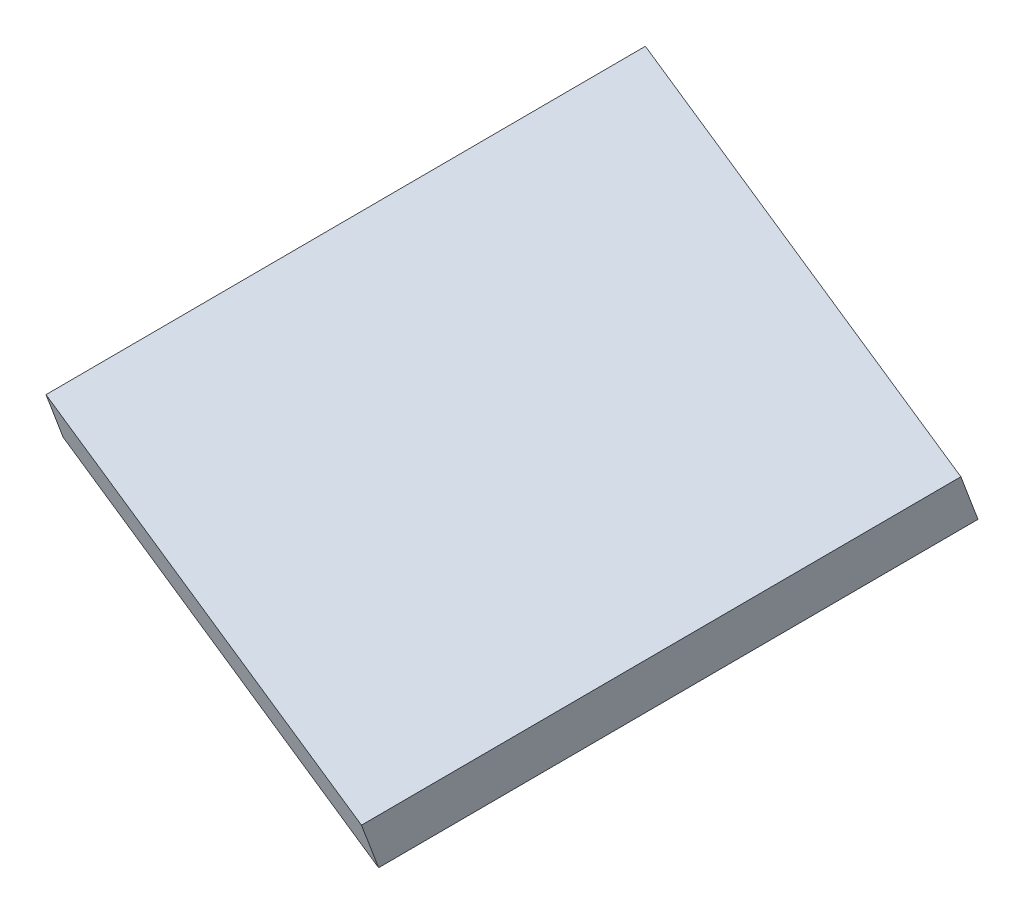
ISO-10303-21;
HEADER;
FILE_DESCRIPTION(('STEP AP214'),'2;1');
FILE_NAME('part.step','',(''),(''),'','','');
FILE_SCHEMA(('AUTOMOTIVE_DESIGN { 1 0 10303 214 1 1 1 1 }'));
ENDSEC;
DATA;
#1=APPLICATION_CONTEXT('core data for automotive mechanical design processes');
#2=APPLICATION_PROTOCOL_DEFINITION('international standard','automotive_design',2000,#1);
#3=PRODUCT_CONTEXT('',#1,'mechanical');
#4=PRODUCT('Part','Part','',(#3));
#5=PRODUCT_RELATED_PRODUCT_CATEGORY('part','',(#4));
#6=PRODUCT_DEFINITION_FORMATION('','',#4);
#7=PRODUCT_DEFINITION_CONTEXT('part definition',#1,'design');
#8=PRODUCT_DEFINITION('design','',#6,#7);
#9=PRODUCT_DEFINITION_SHAPE('','',#8);
#10=(LENGTH_UNIT() NAMED_UNIT(*) SI_UNIT(.MILLI.,.METRE.));
#11=(NAMED_UNIT(*) PLANE_ANGLE_UNIT() SI_UNIT($,.RADIAN.));
#12=(NAMED_UNIT(*) SI_UNIT($,.STERADIAN.) SOLID_ANGLE_UNIT());
#13=UNCERTAINTY_MEASURE_WITH_UNIT(LENGTH_MEASURE(1.E-05),#10,'distance_accuracy_value','');
#14=(GEOMETRIC_REPRESENTATION_CONTEXT(3) GLOBAL_UNCERTAINTY_ASSIGNED_CONTEXT((#13)) GLOBAL_UNIT_ASSIGNED_CONTEXT((#10,
#11,#12)) REPRESENTATION_CONTEXT('',''));
#15=CARTESIAN_POINT('',(0.,0.,0.));
#16=DIRECTION('',(0.,0.,1.));
#17=DIRECTION('',(1.,0.,0.));
#18=AXIS2_PLACEMENT_3D('',#15,#16,#17);
#19=CARTESIAN_POINT('',(-209.831180180401,91.4337702418302,236.212830950044));
#20=DIRECTION('',(0.331348582738774,0.335518089768333,-0.881836565444649));
#21=DIRECTION('',(0.,0.934635619138035,0.355606888907488));
#22=AXIS2_PLACEMENT_3D('',#19,#20,#21);
#23=PLANE('',#22);
#24=DIRECTION('',(0.943421724808399,-0.130488029810082,0.304841472302947));
#25=VECTOR('',#24,1.);
#26=CARTESIAN_POINT('',(-209.895126618252,86.7690074249378,234.413970556566));
#27=LINE('',#26,#25);
#28=CARTESIAN_POINT('',(-257.066212858671,93.2934089154419,219.171896941419));
#29=VERTEX_POINT('',#28);
#30=CARTESIAN_POINT('',(-209.895126618252,86.7690074249378,234.413970556566));
#31=VERTEX_POINT('',#30);
#32=EDGE_CURVE('E77',#29,#31,#27,.T.);
#33=ORIENTED_EDGE('',*,*,#32,.T.);
#34=DIRECTION('',(-0.0127892875701102,-0.932952563378488,-0.359772078695605));
#35=VECTOR('',#34,1.);
#36=CARTESIAN_POINT('',(-209.831180180401,91.4337702418302,236.212830950044));
#37=LINE('',#36,#35);
#38=CARTESIAN_POINT('',(-209.831180180401,91.4337702418302,236.212830950044));
#39=VERTEX_POINT('',#38);
#40=EDGE_CURVE('E11',#39,#31,#37,.T.);
#41=ORIENTED_EDGE('',*,*,#40,.F.);
#42=DIRECTION('',(0.943421724808398,-0.130488029810081,0.30484147230295));
#43=VECTOR('',#42,1.);
#44=CARTESIAN_POINT('',(-245.557348824334,96.3751842843745,224.668876043376));
#45=LINE('',#44,#43);
#46=CARTESIAN_POINT('',(-257.002266420821,97.9581717323343,220.970757334897));
#47=VERTEX_POINT('',#46);
#48=EDGE_CURVE('E82',#47,#39,#45,.T.);
#49=ORIENTED_EDGE('',*,*,#48,.F.);
#50=DIRECTION('',(-0.0127892875701102,-0.932952563378488,-0.359772078695605));
#51=VECTOR('',#50,1.);
#52=CARTESIAN_POINT('',(-257.002266420821,97.9581717323343,220.970757334897));
#53=LINE('',#52,#51);
#54=EDGE_CURVE('E97',#47,#29,#53,.T.);
#55=ORIENTED_EDGE('',*,*,#54,.T.);
#56=EDGE_LOOP('',(#33,#41,#49,#55));
#57=FACE_BOUND('',#56,.T.);
#58=ADVANCED_FACE('F37',(#57),#23,.F.);
#59=CARTESIAN_POINT('',(-193.263751043462,108.209674730247,192.121002677812));
#60=DIRECTION('',(-0.943421724808399,0.130488029810082,-0.304841472302948));
#61=DIRECTION('',(-0.307470379466994,0.,0.951557652352406));
#62=AXIS2_PLACEMENT_3D('',#59,#60,#61);
#63=PLANE('',#62);
#64=DIRECTION('',(0.331348582738775,0.335518089768333,-0.881836565444648));
#65=VECTOR('',#64,1.);
#66=CARTESIAN_POINT('',(-193.327697481313,103.544911913354,190.322142284334));
#67=LINE('',#66,#65);
#68=CARTESIAN_POINT('',(-193.327697481313,103.544911913354,190.322142284334));
#69=VERTEX_POINT('',#68);
#70=EDGE_CURVE('E93',#31,#69,#67,.T.);
#71=ORIENTED_EDGE('',*,*,#70,.T.);
#72=DIRECTION('',(-0.0127892875701102,-0.932952563378488,-0.359772078695605));
#73=VECTOR('',#72,1.);
#74=CARTESIAN_POINT('',(-193.263751043462,108.209674730247,192.121002677812));
#75=LINE('',#74,#73);
#76=CARTESIAN_POINT('',(-193.263751043462,108.209674730247,192.121002677812));
#77=VERTEX_POINT('',#76);
#78=EDGE_CURVE('E45',#77,#69,#75,.T.);
#79=ORIENTED_EDGE('',*,*,#78,.F.);
#80=DIRECTION('',(0.331348582738775,0.335518089768333,-0.881836565444648));
#81=VECTOR('',#80,1.);
#82=CARTESIAN_POINT('',(-193.263751043462,108.209674730247,192.121002677812));
#83=LINE('',#82,#81);
#84=EDGE_CURVE('E85',#39,#77,#83,.T.);
#85=ORIENTED_EDGE('',*,*,#84,.F.);
#86=ORIENTED_EDGE('',*,*,#40,.T.);
#87=EDGE_LOOP('',(#71,#79,#85,#86));
#88=FACE_BOUND('',#87,.T.);
#89=ADVANCED_FACE('F92',(#88),#63,.F.);
#90=CARTESIAN_POINT('',(-240.434837283882,114.734076220751,176.878929062665));
#91=DIRECTION('',(-0.331348582738774,-0.335518089768333,0.881836565444649));
#92=DIRECTION('',(0.,-0.934635619138034,-0.355606888907488));
#93=AXIS2_PLACEMENT_3D('',#90,#91,#92);
#94=PLANE('',#93);
#95=DIRECTION('',(-0.943421724808399,0.130488029810081,-0.304841472302948));
#96=VECTOR('',#95,1.);
#97=CARTESIAN_POINT('',(-240.498783721733,110.069313403859,175.080068669187));
#98=LINE('',#97,#96);
#99=CARTESIAN_POINT('',(-240.498783721733,110.069313403859,175.080068669187));
#100=VERTEX_POINT('',#99);
#101=EDGE_CURVE('E70',#69,#100,#98,.T.);
#102=ORIENTED_EDGE('',*,*,#101,.T.);
#103=DIRECTION('',(-0.0127892875701102,-0.932952563378488,-0.359772078695605));
#104=VECTOR('',#103,1.);
#105=CARTESIAN_POINT('',(-240.434837283882,114.734076220751,176.878929062665));
#106=LINE('',#105,#104);
#107=CARTESIAN_POINT('',(-240.434837283882,114.734076220751,176.878929062665));
#108=VERTEX_POINT('',#107);
#109=EDGE_CURVE('E94',#108,#100,#106,.T.);
#110=ORIENTED_EDGE('',*,*,#109,.F.);
#111=DIRECTION('',(-0.943421724808399,0.130488029810081,-0.304841472302948));
#112=VECTOR('',#111,1.);
#113=CARTESIAN_POINT('',(-240.434837283882,114.734076220751,176.878929062665));
#114=LINE('',#113,#112);
#115=EDGE_CURVE('E89',#77,#108,#114,.T.);
#116=ORIENTED_EDGE('',*,*,#115,.F.);
#117=ORIENTED_EDGE('',*,*,#78,.T.);
#118=EDGE_LOOP('',(#102,#110,#116,#117));
#119=FACE_BOUND('',#118,.T.);
#120=ADVANCED_FACE('F95',(#119),#94,.F.);
#121=CARTESIAN_POINT('',(-257.002266420821,97.9581717323343,220.970757334897));
#122=DIRECTION('',(0.943421724808399,-0.130488029810081,0.304841472302947));
#123=DIRECTION('',(0.307470379466993,0.,-0.951557652352406));
#124=AXIS2_PLACEMENT_3D('',#121,#122,#123);
#125=PLANE('',#124);
#126=DIRECTION('',(-0.331348582738774,-0.335518089768333,0.881836565444649));
#127=VECTOR('',#126,1.);
#128=CARTESIAN_POINT('',(-257.066212858671,93.2934089154419,219.171896941419));
#129=LINE('',#128,#127);
#130=EDGE_CURVE('E104',#100,#29,#129,.T.);
#131=ORIENTED_EDGE('',*,*,#130,.T.);
#132=ORIENTED_EDGE('',*,*,#54,.F.);
#133=DIRECTION('',(-0.331348582738774,-0.335518089768333,0.881836565444649));
#134=VECTOR('',#133,1.);
#135=CARTESIAN_POINT('',(-257.002266420821,97.9581717323343,220.970757334897));
#136=LINE('',#135,#134);
#137=EDGE_CURVE('E53',#108,#47,#136,.T.);
#138=ORIENTED_EDGE('',*,*,#137,.F.);
#139=ORIENTED_EDGE('',*,*,#109,.T.);
#140=EDGE_LOOP('',(#131,#132,#138,#139));
#141=FACE_BOUND('',#140,.T.);
#142=ADVANCED_FACE('F109',(#141),#125,.F.);
#143=CARTESIAN_POINT('',(2.14351734023535,156.365238192991,60.2987214877328));
#144=DIRECTION('',(-0.0127892875701093,-0.932952563378488,-0.359772078695605));
#145=DIRECTION('',(0.,0.359801505523278,-0.933028872341678));
#146=AXIS2_PLACEMENT_3D('',#143,#144,#145);
#147=PLANE('',#146);
#148=ORIENTED_EDGE('',*,*,#48,.T.);
#149=ORIENTED_EDGE('',*,*,#84,.T.);
#150=ORIENTED_EDGE('',*,*,#115,.T.);
#151=ORIENTED_EDGE('',*,*,#137,.T.);
#152=EDGE_LOOP('',(#148,#149,#150,#151));
#153=FACE_BOUND('',#152,.T.);
#154=ADVANCED_FACE('F87',(#153),#147,.F.);
#155=CARTESIAN_POINT('',(2.0795709023848,151.700475376099,58.4998610942548));
#156=DIRECTION('',(-0.0127892875701093,-0.932952563378488,-0.359772078695605));
#157=DIRECTION('',(0.,0.359801505523278,-0.933028872341678));
#158=AXIS2_PLACEMENT_3D('',#155,#156,#157);
#159=PLANE('',#158);
#160=ORIENTED_EDGE('',*,*,#32,.F.);
#161=ORIENTED_EDGE('',*,*,#130,.F.);
#162=ORIENTED_EDGE('',*,*,#101,.F.);
#163=ORIENTED_EDGE('',*,*,#70,.F.);
#164=EDGE_LOOP('',(#160,#161,#162,#163));
#165=FACE_BOUND('',#164,.T.);
#166=ADVANCED_FACE('F110',(#165),#159,.T.);
#167=CLOSED_SHELL('',(#58,#89,#120,#142,#154,#166));
#168=MANIFOLD_SOLID_BREP('B2',#167);
#169=ADVANCED_BREP_SHAPE_REPRESENTATION('',(#18,#168),#14);
#170=SHAPE_DEFINITION_REPRESENTATION(#9,#169);
ENDSEC;
END-ISO-10303-21;
